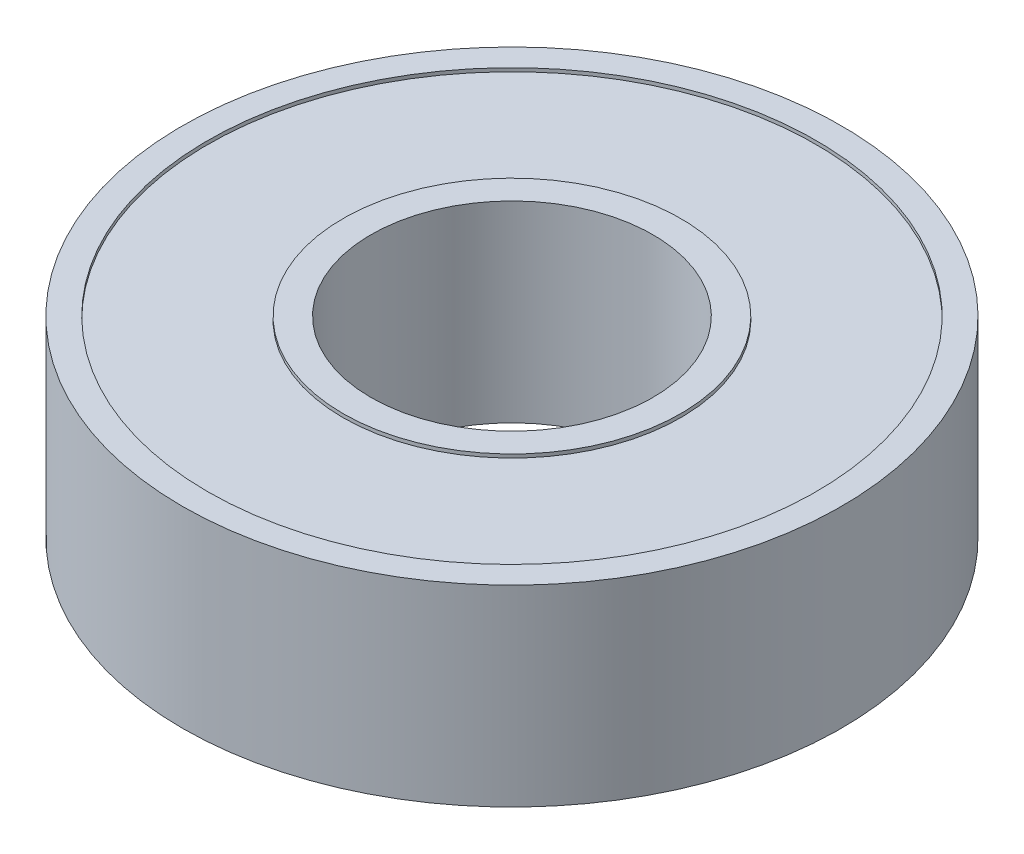
ISO-10303-21;
HEADER;
FILE_DESCRIPTION(('STEP AP214'),'2;1');
FILE_NAME('part.step','',(''),(''),'','','');
FILE_SCHEMA(('AUTOMOTIVE_DESIGN { 1 0 10303 214 1 1 1 1 }'));
ENDSEC;
DATA;
#1=APPLICATION_CONTEXT('core data for automotive mechanical design processes');
#2=APPLICATION_PROTOCOL_DEFINITION('international standard','automotive_design',2000,#1);
#3=PRODUCT_CONTEXT('',#1,'mechanical');
#4=PRODUCT('Part','Part','',(#3));
#5=PRODUCT_RELATED_PRODUCT_CATEGORY('part','',(#4));
#6=PRODUCT_DEFINITION_FORMATION('','',#4);
#7=PRODUCT_DEFINITION_CONTEXT('part definition',#1,'design');
#8=PRODUCT_DEFINITION('design','',#6,#7);
#9=PRODUCT_DEFINITION_SHAPE('','',#8);
#10=(LENGTH_UNIT() NAMED_UNIT(*) SI_UNIT(.MILLI.,.METRE.));
#11=(NAMED_UNIT(*) PLANE_ANGLE_UNIT() SI_UNIT($,.RADIAN.));
#12=(NAMED_UNIT(*) SI_UNIT($,.STERADIAN.) SOLID_ANGLE_UNIT());
#13=UNCERTAINTY_MEASURE_WITH_UNIT(LENGTH_MEASURE(1.E-05),#10,'distance_accuracy_value','');
#14=(GEOMETRIC_REPRESENTATION_CONTEXT(3) GLOBAL_UNCERTAINTY_ASSIGNED_CONTEXT((#13)) GLOBAL_UNIT_ASSIGNED_CONTEXT((#10,
#11,#12)) REPRESENTATION_CONTEXT('',''));
#15=CARTESIAN_POINT('',(0.,0.,0.));
#16=DIRECTION('',(0.,0.,1.));
#17=DIRECTION('',(1.,0.,0.));
#18=AXIS2_PLACEMENT_3D('',#15,#16,#17);
#19=CARTESIAN_POINT('',(0.,8.,0.));
#20=DIRECTION('',(0.,1.,0.));
#21=DIRECTION('',(0.,0.,1.));
#22=AXIS2_PLACEMENT_3D('',#19,#20,#21);
#23=PLANE('',#22);
#24=CARTESIAN_POINT('',(0.,8.,0.));
#25=DIRECTION('',(0.,1.,0.));
#26=DIRECTION('',(0.,0.,1.));
#27=AXIS2_PLACEMENT_3D('',#24,#25,#26);
#28=CIRCLE('',#27,12.899809836775);
#29=CARTESIAN_POINT('',(0.,8.,12.899809836775));
#30=VERTEX_POINT('',#29);
#31=EDGE_CURVE('E10',#30,#30,#28,.F.);
#32=ORIENTED_EDGE('',*,*,#31,.F.);
#33=EDGE_LOOP('',(#32));
#34=FACE_BOUND('',#33,.T.);
#35=CARTESIAN_POINT('',(0.,8.,0.));
#36=DIRECTION('',(0.,1.,0.));
#37=DIRECTION('',(0.,0.,1.));
#38=AXIS2_PLACEMENT_3D('',#35,#36,#37);
#39=CIRCLE('',#38,7.16330987705155);
#40=CARTESIAN_POINT('',(0.,8.,7.16330987705155));
#41=VERTEX_POINT('',#40);
#42=EDGE_CURVE('E51',#41,#41,#39,.T.);
#43=ORIENTED_EDGE('',*,*,#42,.F.);
#44=EDGE_LOOP('',(#43));
#45=FACE_BOUND('',#44,.T.);
#46=ADVANCED_FACE('F31',(#34,#45),#23,.T.);
#47=CARTESIAN_POINT('',(0.,8.,0.));
#48=DIRECTION('',(0.,-1.,0.));
#49=DIRECTION('',(0.,0.,-1.));
#50=AXIS2_PLACEMENT_3D('',#47,#48,#49);
#51=CYLINDRICAL_SURFACE('',#50,13.975);
#52=CARTESIAN_POINT('',(0.,0.,0.));
#53=DIRECTION('',(0.,1.,0.));
#54=DIRECTION('',(0.,0.,1.));
#55=AXIS2_PLACEMENT_3D('',#52,#53,#54);
#56=CIRCLE('',#55,13.975);
#57=CARTESIAN_POINT('',(0.,0.,13.975));
#58=VERTEX_POINT('',#57);
#59=EDGE_CURVE('E35',#58,#58,#56,.T.);
#60=ORIENTED_EDGE('',*,*,#59,.T.);
#61=EDGE_LOOP('',(#60));
#62=FACE_BOUND('',#61,.T.);
#63=CARTESIAN_POINT('',(0.,8.15,0.));
#64=DIRECTION('',(0.,1.,0.));
#65=DIRECTION('',(0.,0.,1.));
#66=AXIS2_PLACEMENT_3D('',#63,#64,#65);
#67=CIRCLE('',#66,13.975);
#68=CARTESIAN_POINT('',(0.,8.15,13.975));
#69=VERTEX_POINT('',#68);
#70=EDGE_CURVE('E46',#69,#69,#67,.T.);
#71=ORIENTED_EDGE('',*,*,#70,.F.);
#72=EDGE_LOOP('',(#71));
#73=FACE_BOUND('',#72,.T.);
#74=ADVANCED_FACE('F33',(#62,#73),#51,.T.);
#75=CARTESIAN_POINT('',(0.,0.,0.));
#76=DIRECTION('',(0.,1.,0.));
#77=DIRECTION('',(0.,0.,1.));
#78=AXIS2_PLACEMENT_3D('',#75,#76,#77);
#79=PLANE('',#78);
#80=CARTESIAN_POINT('',(0.,0.,0.));
#81=DIRECTION('',(0.,1.,0.));
#82=DIRECTION('',(0.,0.,1.));
#83=AXIS2_PLACEMENT_3D('',#80,#81,#82);
#84=CIRCLE('',#83,5.98);
#85=CARTESIAN_POINT('',(0.,0.,5.98));
#86=VERTEX_POINT('',#85);
#87=EDGE_CURVE('E43',#86,#86,#84,.T.);
#88=ORIENTED_EDGE('',*,*,#87,.T.);
#89=EDGE_LOOP('',(#88));
#90=FACE_BOUND('',#89,.T.);
#91=ORIENTED_EDGE('',*,*,#59,.F.);
#92=EDGE_LOOP('',(#91));
#93=FACE_BOUND('',#92,.T.);
#94=ADVANCED_FACE('F59',(#90,#93),#79,.F.);
#95=CARTESIAN_POINT('',(0.,0.,0.));
#96=DIRECTION('',(0.,1.,0.));
#97=DIRECTION('',(0.,0.,1.));
#98=AXIS2_PLACEMENT_3D('',#95,#96,#97);
#99=CYLINDRICAL_SURFACE('',#98,5.98);
#100=ORIENTED_EDGE('',*,*,#87,.F.);
#101=EDGE_LOOP('',(#100));
#102=FACE_BOUND('',#101,.T.);
#103=CARTESIAN_POINT('',(0.,8.15,0.));
#104=DIRECTION('',(0.,1.,0.));
#105=DIRECTION('',(0.,0.,1.));
#106=AXIS2_PLACEMENT_3D('',#103,#104,#105);
#107=CIRCLE('',#106,5.98);
#108=CARTESIAN_POINT('',(0.,8.15,5.98));
#109=VERTEX_POINT('',#108);
#110=EDGE_CURVE('E48',#109,#109,#107,.T.);
#111=ORIENTED_EDGE('',*,*,#110,.T.);
#112=EDGE_LOOP('',(#111));
#113=FACE_BOUND('',#112,.T.);
#114=ADVANCED_FACE('F62',(#102,#113),#99,.F.);
#115=CARTESIAN_POINT('',(0.,8.15,0.));
#116=DIRECTION('',(0.,1.,0.));
#117=DIRECTION('',(0.,0.,1.));
#118=AXIS2_PLACEMENT_3D('',#115,#116,#117);
#119=PLANE('',#118);
#120=CARTESIAN_POINT('',(0.,8.15,0.));
#121=DIRECTION('',(0.,1.,0.));
#122=DIRECTION('',(0.,0.,1.));
#123=AXIS2_PLACEMENT_3D('',#120,#121,#122);
#124=CIRCLE('',#123,7.16330987705155);
#125=CARTESIAN_POINT('',(0.,8.15,7.16330987705155));
#126=VERTEX_POINT('',#125);
#127=EDGE_CURVE('E52',#126,#126,#124,.T.);
#128=ORIENTED_EDGE('',*,*,#127,.T.);
#129=EDGE_LOOP('',(#128));
#130=FACE_BOUND('',#129,.T.);
#131=ORIENTED_EDGE('',*,*,#110,.F.);
#132=EDGE_LOOP('',(#131));
#133=FACE_BOUND('',#132,.T.);
#134=ADVANCED_FACE('F65',(#130,#133),#119,.T.);
#135=CARTESIAN_POINT('',(0.,8.15,0.));
#136=DIRECTION('',(0.,-1.,0.));
#137=DIRECTION('',(0.,0.,-1.));
#138=AXIS2_PLACEMENT_3D('',#135,#136,#137);
#139=CYLINDRICAL_SURFACE('',#138,7.16330987705155);
#140=ORIENTED_EDGE('',*,*,#127,.F.);
#141=EDGE_LOOP('',(#140));
#142=FACE_BOUND('',#141,.T.);
#143=ORIENTED_EDGE('',*,*,#42,.T.);
#144=EDGE_LOOP('',(#143));
#145=FACE_BOUND('',#144,.T.);
#146=ADVANCED_FACE('F70',(#142,#145),#139,.T.);
#147=CARTESIAN_POINT('',(0.,8.15,0.));
#148=DIRECTION('',(0.,1.,0.));
#149=DIRECTION('',(0.,0.,1.));
#150=AXIS2_PLACEMENT_3D('',#147,#148,#149);
#151=PLANE('',#150);
#152=ORIENTED_EDGE('',*,*,#70,.T.);
#153=EDGE_LOOP('',(#152));
#154=FACE_BOUND('',#153,.T.);
#155=CARTESIAN_POINT('',(0.,8.15,0.));
#156=DIRECTION('',(0.,1.,0.));
#157=DIRECTION('',(0.,0.,1.));
#158=AXIS2_PLACEMENT_3D('',#155,#156,#157);
#159=CIRCLE('',#158,12.899809836775);
#160=CARTESIAN_POINT('',(0.,8.15,12.899809836775));
#161=VERTEX_POINT('',#160);
#162=EDGE_CURVE('E143',#161,#161,#159,.T.);
#163=ORIENTED_EDGE('',*,*,#162,.F.);
#164=EDGE_LOOP('',(#163));
#165=FACE_BOUND('',#164,.T.);
#166=ADVANCED_FACE('F76',(#154,#165),#151,.T.);
#167=CARTESIAN_POINT('',(0.,8.15,0.));
#168=DIRECTION('',(0.,-1.,0.));
#169=DIRECTION('',(0.,0.,-1.));
#170=AXIS2_PLACEMENT_3D('',#167,#168,#169);
#171=CYLINDRICAL_SURFACE('',#170,12.899809836775);
#172=ORIENTED_EDGE('',*,*,#31,.T.);
#173=EDGE_LOOP('',(#172));
#174=FACE_BOUND('',#173,.T.);
#175=ORIENTED_EDGE('',*,*,#162,.T.);
#176=EDGE_LOOP('',(#175));
#177=FACE_BOUND('',#176,.T.);
#178=ADVANCED_FACE('F129',(#174,#177),#171,.F.);
#179=CLOSED_SHELL('',(#46,#74,#94,#114,#134,#146,#166,#178));
#180=MANIFOLD_SOLID_BREP('B2',#179);
#181=ADVANCED_BREP_SHAPE_REPRESENTATION('',(#18,#180),#14);
#182=SHAPE_DEFINITION_REPRESENTATION(#9,#181);
ENDSEC;
END-ISO-10303-21;
